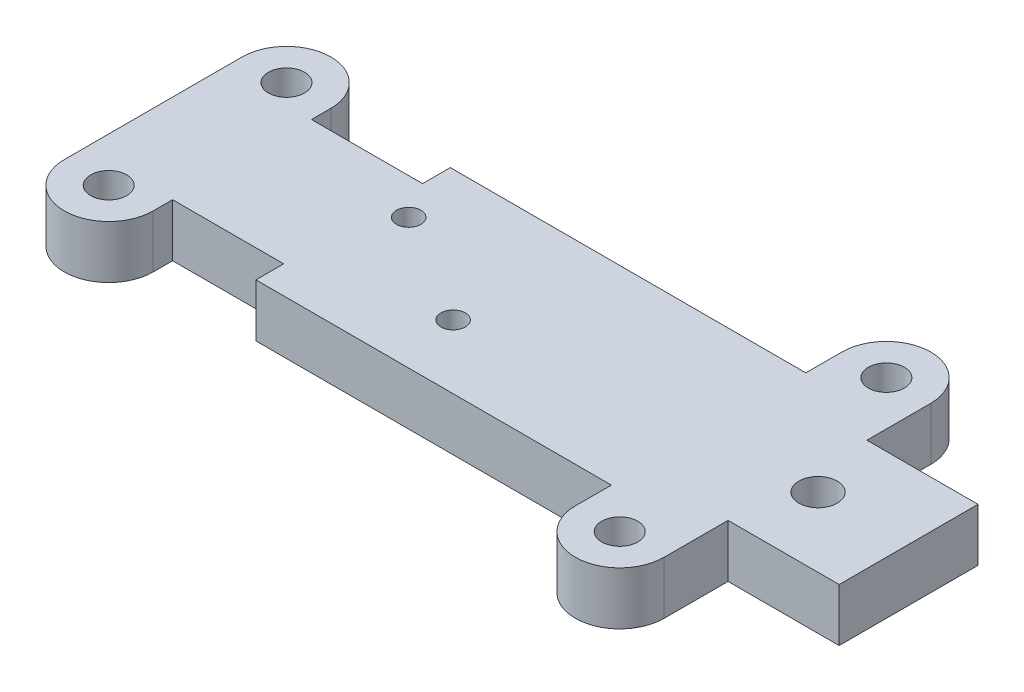
ISO-10303-21;
HEADER;
FILE_DESCRIPTION(('STEP AP214'),'2;1');
FILE_NAME('part.step','',(''),(''),'','','');
FILE_SCHEMA(('AUTOMOTIVE_DESIGN { 1 0 10303 214 1 1 1 1 }'));
ENDSEC;
DATA;
#1=APPLICATION_CONTEXT('core data for automotive mechanical design processes');
#2=APPLICATION_PROTOCOL_DEFINITION('international standard','automotive_design',2000,#1);
#3=PRODUCT_CONTEXT('',#1,'mechanical');
#4=PRODUCT('Part','Part','',(#3));
#5=PRODUCT_RELATED_PRODUCT_CATEGORY('part','',(#4));
#6=PRODUCT_DEFINITION_FORMATION('','',#4);
#7=PRODUCT_DEFINITION_CONTEXT('part definition',#1,'design');
#8=PRODUCT_DEFINITION('design','',#6,#7);
#9=PRODUCT_DEFINITION_SHAPE('','',#8);
#10=(LENGTH_UNIT() NAMED_UNIT(*) SI_UNIT(.MILLI.,.METRE.));
#11=(NAMED_UNIT(*) PLANE_ANGLE_UNIT() SI_UNIT($,.RADIAN.));
#12=(NAMED_UNIT(*) SI_UNIT($,.STERADIAN.) SOLID_ANGLE_UNIT());
#13=UNCERTAINTY_MEASURE_WITH_UNIT(LENGTH_MEASURE(1.E-05),#10,'distance_accuracy_value','');
#14=(GEOMETRIC_REPRESENTATION_CONTEXT(3) GLOBAL_UNCERTAINTY_ASSIGNED_CONTEXT((#13)) GLOBAL_UNIT_ASSIGNED_CONTEXT((#10,
#11,#12)) REPRESENTATION_CONTEXT('',''));
#15=CARTESIAN_POINT('',(0.,0.,0.));
#16=DIRECTION('',(0.,0.,1.));
#17=DIRECTION('',(1.,0.,0.));
#18=AXIS2_PLACEMENT_3D('',#15,#16,#17);
#19=CARTESIAN_POINT('',(29.,4.7625,-12.));
#20=DIRECTION('',(0.,-1.,0.));
#21=DIRECTION('',(0.,0.,-1.));
#22=AXIS2_PLACEMENT_3D('',#19,#20,#21);
#23=PLANE('',#22);
#24=CARTESIAN_POINT('',(-21.,4.7625,8.));
#25=DIRECTION('',(0.,-1.,0.));
#26=DIRECTION('',(0.,0.,-1.));
#27=AXIS2_PLACEMENT_3D('',#24,#25,#26);
#28=CIRCLE('',#27,1.625);
#29=CARTESIAN_POINT('',(-21.,4.7625,6.375));
#30=VERTEX_POINT('',#29);
#31=EDGE_CURVE('E392',#30,#30,#28,.T.);
#32=ORIENTED_EDGE('',*,*,#31,.T.);
#33=EDGE_LOOP('',(#32));
#34=FACE_BOUND('',#33,.T.);
#35=CARTESIAN_POINT('',(29.,4.7625,12.));
#36=DIRECTION('',(0.,-1.,0.));
#37=DIRECTION('',(0.,0.,-1.));
#38=AXIS2_PLACEMENT_3D('',#35,#36,#37);
#39=CIRCLE('',#38,1.625);
#40=CARTESIAN_POINT('',(29.,4.7625,10.375));
#41=VERTEX_POINT('',#40);
#42=EDGE_CURVE('E386',#41,#41,#39,.T.);
#43=ORIENTED_EDGE('',*,*,#42,.T.);
#44=EDGE_LOOP('',(#43));
#45=FACE_BOUND('',#44,.T.);
#46=CARTESIAN_POINT('',(29.,4.7625,-12.));
#47=DIRECTION('',(0.,1.,0.));
#48=DIRECTION('',(0.,0.,1.));
#49=AXIS2_PLACEMENT_3D('',#46,#47,#48);
#50=CIRCLE('',#49,1.625);
#51=CARTESIAN_POINT('',(29.,4.7625,-10.375));
#52=VERTEX_POINT('',#51);
#53=EDGE_CURVE('E249',#52,#52,#50,.T.);
#54=ORIENTED_EDGE('',*,*,#53,.F.);
#55=EDGE_LOOP('',(#54));
#56=FACE_BOUND('',#55,.T.);
#57=DIRECTION('',(-1.,0.,0.));
#58=VECTOR('',#57,1.);
#59=CARTESIAN_POINT('',(-17.,4.7625,-6.25));
#60=LINE('',#59,#58);
#61=CARTESIAN_POINT('',(-7.,4.7625,-6.25));
#62=VERTEX_POINT('',#61);
#63=CARTESIAN_POINT('',(-17.,4.7625,-6.25));
#64=VERTEX_POINT('',#63);
#65=EDGE_CURVE('E171',#62,#64,#60,.T.);
#66=ORIENTED_EDGE('',*,*,#65,.T.);
#67=DIRECTION('',(0.,0.,-1.));
#68=VECTOR('',#67,1.);
#69=CARTESIAN_POINT('',(-17.,4.7625,-6.25));
#70=LINE('',#69,#68);
#71=CARTESIAN_POINT('',(-17.,4.7625,-8.));
#72=VERTEX_POINT('',#71);
#73=EDGE_CURVE('E103',#64,#72,#70,.T.);
#74=ORIENTED_EDGE('',*,*,#73,.T.);
#75=CARTESIAN_POINT('',(-21.,4.7625,-8.));
#76=DIRECTION('',(0.,1.,0.));
#77=DIRECTION('',(0.,0.,1.));
#78=AXIS2_PLACEMENT_3D('',#75,#76,#77);
#79=CIRCLE('',#78,4.);
#80=CARTESIAN_POINT('',(-25.,4.7625,-8.));
#81=VERTEX_POINT('',#80);
#82=EDGE_CURVE('E193',#72,#81,#79,.T.);
#83=ORIENTED_EDGE('',*,*,#82,.T.);
#84=DIRECTION('',(0.,0.,1.));
#85=VECTOR('',#84,1.);
#86=CARTESIAN_POINT('',(-25.,4.7625,-8.));
#87=LINE('',#86,#85);
#88=CARTESIAN_POINT('',(-25.,4.7625,8.));
#89=VERTEX_POINT('',#88);
#90=EDGE_CURVE('E262',#81,#89,#87,.T.);
#91=ORIENTED_EDGE('',*,*,#90,.T.);
#92=CARTESIAN_POINT('',(-21.,4.7625,8.));
#93=DIRECTION('',(0.,-1.,0.));
#94=DIRECTION('',(0.,0.,-1.));
#95=AXIS2_PLACEMENT_3D('',#92,#93,#94);
#96=CIRCLE('',#95,4.);
#97=CARTESIAN_POINT('',(-17.,4.7625,8.));
#98=VERTEX_POINT('',#97);
#99=EDGE_CURVE('E219',#98,#89,#96,.T.);
#100=ORIENTED_EDGE('',*,*,#99,.F.);
#101=DIRECTION('',(0.,0.,1.));
#102=VECTOR('',#101,1.);
#103=CARTESIAN_POINT('',(-17.,4.7625,6.25));
#104=LINE('',#103,#102);
#105=CARTESIAN_POINT('',(-17.,4.7625,6.25));
#106=VERTEX_POINT('',#105);
#107=EDGE_CURVE('E420',#106,#98,#104,.T.);
#108=ORIENTED_EDGE('',*,*,#107,.F.);
#109=DIRECTION('',(-1.,0.,0.));
#110=VECTOR('',#109,1.);
#111=CARTESIAN_POINT('',(-17.,4.7625,6.25));
#112=LINE('',#111,#110);
#113=CARTESIAN_POINT('',(-7.,4.7625,6.25));
#114=VERTEX_POINT('',#113);
#115=EDGE_CURVE('E397',#114,#106,#112,.T.);
#116=ORIENTED_EDGE('',*,*,#115,.F.);
#117=DIRECTION('',(0.,0.,-1.));
#118=VECTOR('',#117,1.);
#119=CARTESIAN_POINT('',(-7.,4.7625,8.75));
#120=LINE('',#119,#118);
#121=CARTESIAN_POINT('',(-7.,4.7625,8.75));
#122=VERTEX_POINT('',#121);
#123=EDGE_CURVE('E400',#122,#114,#120,.T.);
#124=ORIENTED_EDGE('',*,*,#123,.F.);
#125=DIRECTION('',(-1.,0.,0.));
#126=VECTOR('',#125,1.);
#127=CARTESIAN_POINT('',(-7.,4.7625,8.75));
#128=LINE('',#127,#126);
#129=CARTESIAN_POINT('',(25.,4.7625,8.75));
#130=VERTEX_POINT('',#129);
#131=EDGE_CURVE('E404',#130,#122,#128,.T.);
#132=ORIENTED_EDGE('',*,*,#131,.F.);
#133=DIRECTION('',(0.,0.,-1.));
#134=VECTOR('',#133,1.);
#135=CARTESIAN_POINT('',(25.,4.7625,8.75));
#136=LINE('',#135,#134);
#137=CARTESIAN_POINT('',(25.,4.7625,12.));
#138=VERTEX_POINT('',#137);
#139=EDGE_CURVE('E407',#138,#130,#136,.T.);
#140=ORIENTED_EDGE('',*,*,#139,.F.);
#141=CARTESIAN_POINT('',(29.,4.7625,12.));
#142=DIRECTION('',(0.,-1.,0.));
#143=DIRECTION('',(0.,0.,1.));
#144=AXIS2_PLACEMENT_3D('',#141,#142,#143);
#145=CIRCLE('',#144,4.);
#146=CARTESIAN_POINT('',(33.,4.7625,12.));
#147=VERTEX_POINT('',#146);
#148=EDGE_CURVE('E410',#147,#138,#145,.T.);
#149=ORIENTED_EDGE('',*,*,#148,.F.);
#150=DIRECTION('',(0.,0.,1.));
#151=VECTOR('',#150,1.);
#152=CARTESIAN_POINT('',(33.,4.7625,6.25));
#153=LINE('',#152,#151);
#154=CARTESIAN_POINT('',(33.,4.7625,6.25));
#155=VERTEX_POINT('',#154);
#156=EDGE_CURVE('E413',#155,#147,#153,.T.);
#157=ORIENTED_EDGE('',*,*,#156,.F.);
#158=DIRECTION('',(-1.,0.,0.));
#159=VECTOR('',#158,1.);
#160=CARTESIAN_POINT('',(33.,4.7625,6.25));
#161=LINE('',#160,#159);
#162=CARTESIAN_POINT('',(43.,4.7625,6.25));
#163=VERTEX_POINT('',#162);
#164=EDGE_CURVE('E416',#163,#155,#161,.T.);
#165=ORIENTED_EDGE('',*,*,#164,.F.);
#166=DIRECTION('',(0.,0.,-1.));
#167=VECTOR('',#166,1.);
#168=CARTESIAN_POINT('',(43.,4.7625,-6.25));
#169=LINE('',#168,#167);
#170=CARTESIAN_POINT('',(43.,4.7625,-6.25));
#171=VERTEX_POINT('',#170);
#172=EDGE_CURVE('E265',#163,#171,#169,.T.);
#173=ORIENTED_EDGE('',*,*,#172,.T.);
#174=DIRECTION('',(-1.,0.,0.));
#175=VECTOR('',#174,1.);
#176=CARTESIAN_POINT('',(33.,4.7625,-6.25));
#177=LINE('',#176,#175);
#178=CARTESIAN_POINT('',(33.,4.7625,-6.25));
#179=VERTEX_POINT('',#178);
#180=EDGE_CURVE('E267',#171,#179,#177,.T.);
#181=ORIENTED_EDGE('',*,*,#180,.T.);
#182=DIRECTION('',(0.,0.,-1.));
#183=VECTOR('',#182,1.);
#184=CARTESIAN_POINT('',(33.,4.7625,-6.25));
#185=LINE('',#184,#183);
#186=CARTESIAN_POINT('',(33.,4.7625,-12.));
#187=VERTEX_POINT('',#186);
#188=EDGE_CURVE('E269',#179,#187,#185,.T.);
#189=ORIENTED_EDGE('',*,*,#188,.T.);
#190=CARTESIAN_POINT('',(29.,4.7625,-12.));
#191=DIRECTION('',(0.,1.,0.));
#192=DIRECTION('',(0.,0.,-1.));
#193=AXIS2_PLACEMENT_3D('',#190,#191,#192);
#194=CIRCLE('',#193,4.);
#195=CARTESIAN_POINT('',(25.,4.7625,-12.));
#196=VERTEX_POINT('',#195);
#197=EDGE_CURVE('E131',#187,#196,#194,.T.);
#198=ORIENTED_EDGE('',*,*,#197,.T.);
#199=DIRECTION('',(0.,0.,1.));
#200=VECTOR('',#199,1.);
#201=CARTESIAN_POINT('',(25.,4.7625,-8.75));
#202=LINE('',#201,#200);
#203=CARTESIAN_POINT('',(25.,4.7625,-8.75));
#204=VERTEX_POINT('',#203);
#205=EDGE_CURVE('E125',#196,#204,#202,.T.);
#206=ORIENTED_EDGE('',*,*,#205,.T.);
#207=DIRECTION('',(-1.,0.,0.));
#208=VECTOR('',#207,1.);
#209=CARTESIAN_POINT('',(-7.,4.7625,-8.75));
#210=LINE('',#209,#208);
#211=CARTESIAN_POINT('',(-7.,4.7625,-8.75));
#212=VERTEX_POINT('',#211);
#213=EDGE_CURVE('E129',#204,#212,#210,.T.);
#214=ORIENTED_EDGE('',*,*,#213,.T.);
#215=DIRECTION('',(0.,0.,1.));
#216=VECTOR('',#215,1.);
#217=CARTESIAN_POINT('',(-7.,4.7625,-8.75));
#218=LINE('',#217,#216);
#219=EDGE_CURVE('E53',#212,#62,#218,.T.);
#220=ORIENTED_EDGE('',*,*,#219,.T.);
#221=EDGE_LOOP('',(#66,#74,#83,#91,#100,#108,#116,#124,#132,#140,#149,#157,#165,#173,#181,#189,
#198,#206,#214,#220));
#222=FACE_BOUND('',#221,.T.);
#223=CARTESIAN_POINT('',(-21.,4.7625,-8.));
#224=DIRECTION('',(0.,1.,0.));
#225=DIRECTION('',(0.,0.,1.));
#226=AXIS2_PLACEMENT_3D('',#223,#224,#225);
#227=CIRCLE('',#226,1.625);
#228=CARTESIAN_POINT('',(-21.,4.7625,-6.375));
#229=VERTEX_POINT('',#228);
#230=EDGE_CURVE('E153',#229,#229,#227,.T.);
#231=ORIENTED_EDGE('',*,*,#230,.F.);
#232=EDGE_LOOP('',(#231));
#233=FACE_BOUND('',#232,.T.);
#234=CARTESIAN_POINT('',(5.,4.7625,3.));
#235=DIRECTION('',(0.,1.,0.));
#236=DIRECTION('',(0.,0.,1.));
#237=AXIS2_PLACEMENT_3D('',#234,#235,#236);
#238=CIRCLE('',#237,1.1);
#239=CARTESIAN_POINT('',(5.,4.7625,4.1));
#240=VERTEX_POINT('',#239);
#241=EDGE_CURVE('E377',#240,#240,#238,.T.);
#242=ORIENTED_EDGE('',*,*,#241,.F.);
#243=EDGE_LOOP('',(#242));
#244=FACE_BOUND('',#243,.T.);
#245=CARTESIAN_POINT('',(-5.,4.7625,-3.));
#246=DIRECTION('',(0.,1.,0.));
#247=DIRECTION('',(0.,0.,1.));
#248=AXIS2_PLACEMENT_3D('',#245,#246,#247);
#249=CIRCLE('',#248,1.1);
#250=CARTESIAN_POINT('',(-5.,4.7625,-1.9));
#251=VERTEX_POINT('',#250);
#252=EDGE_CURVE('E372',#251,#251,#249,.T.);
#253=ORIENTED_EDGE('',*,*,#252,.F.);
#254=EDGE_LOOP('',(#253));
#255=FACE_BOUND('',#254,.T.);
#256=CARTESIAN_POINT('',(34.85,4.7625,0.));
#257=DIRECTION('',(0.,1.,0.));
#258=DIRECTION('',(0.,0.,1.));
#259=AXIS2_PLACEMENT_3D('',#256,#257,#258);
#260=CIRCLE('',#259,1.72719999999999);
#261=CARTESIAN_POINT('',(34.85,4.7625,1.72719999999999));
#262=VERTEX_POINT('',#261);
#263=EDGE_CURVE('E369',#262,#262,#260,.T.);
#264=ORIENTED_EDGE('',*,*,#263,.F.);
#265=EDGE_LOOP('',(#264));
#266=FACE_BOUND('',#265,.T.);
#267=ADVANCED_FACE('F35',(#34,#45,#56,#222,#233,#244,#255,#266),#23,.F.);
#268=CARTESIAN_POINT('',(29.,0.,-12.));
#269=DIRECTION('',(0.,-1.,0.));
#270=DIRECTION('',(0.,0.,-1.));
#271=AXIS2_PLACEMENT_3D('',#268,#269,#270);
#272=PLANE('',#271);
#273=CARTESIAN_POINT('',(34.85,0.,0.));
#274=DIRECTION('',(0.,-1.,0.));
#275=DIRECTION('',(0.,0.,-1.));
#276=AXIS2_PLACEMENT_3D('',#273,#274,#275);
#277=CIRCLE('',#276,1.72719999999999);
#278=CARTESIAN_POINT('',(34.85,0.,-1.72719999999999));
#279=VERTEX_POINT('',#278);
#280=EDGE_CURVE('E39',#279,#279,#277,.T.);
#281=ORIENTED_EDGE('',*,*,#280,.F.);
#282=EDGE_LOOP('',(#281));
#283=FACE_BOUND('',#282,.T.);
#284=CARTESIAN_POINT('',(-5.,0.,-3.));
#285=DIRECTION('',(0.,1.,0.));
#286=DIRECTION('',(0.,0.,1.));
#287=AXIS2_PLACEMENT_3D('',#284,#285,#286);
#288=CIRCLE('',#287,1.1);
#289=CARTESIAN_POINT('',(-5.,0.,-1.9));
#290=VERTEX_POINT('',#289);
#291=EDGE_CURVE('E374',#290,#290,#288,.T.);
#292=ORIENTED_EDGE('',*,*,#291,.T.);
#293=EDGE_LOOP('',(#292));
#294=FACE_BOUND('',#293,.T.);
#295=CARTESIAN_POINT('',(5.,0.,3.));
#296=DIRECTION('',(0.,1.,0.));
#297=DIRECTION('',(0.,0.,1.));
#298=AXIS2_PLACEMENT_3D('',#295,#296,#297);
#299=CIRCLE('',#298,1.1);
#300=CARTESIAN_POINT('',(5.,0.,4.1));
#301=VERTEX_POINT('',#300);
#302=EDGE_CURVE('E380',#301,#301,#299,.T.);
#303=ORIENTED_EDGE('',*,*,#302,.T.);
#304=EDGE_LOOP('',(#303));
#305=FACE_BOUND('',#304,.T.);
#306=CARTESIAN_POINT('',(-21.,0.,-8.));
#307=DIRECTION('',(0.,1.,0.));
#308=DIRECTION('',(0.,0.,1.));
#309=AXIS2_PLACEMENT_3D('',#306,#307,#308);
#310=CIRCLE('',#309,1.625);
#311=CARTESIAN_POINT('',(-21.,0.,-6.375));
#312=VERTEX_POINT('',#311);
#313=EDGE_CURVE('E252',#312,#312,#310,.T.);
#314=ORIENTED_EDGE('',*,*,#313,.T.);
#315=EDGE_LOOP('',(#314));
#316=FACE_BOUND('',#315,.T.);
#317=DIRECTION('',(-1.,0.,0.));
#318=VECTOR('',#317,1.);
#319=CARTESIAN_POINT('',(-17.,0.,-6.25));
#320=LINE('',#319,#318);
#321=CARTESIAN_POINT('',(-7.,0.,-6.25));
#322=VERTEX_POINT('',#321);
#323=CARTESIAN_POINT('',(-17.,0.,-6.25));
#324=VERTEX_POINT('',#323);
#325=EDGE_CURVE('E149',#322,#324,#320,.T.);
#326=ORIENTED_EDGE('',*,*,#325,.F.);
#327=DIRECTION('',(0.,0.,1.));
#328=VECTOR('',#327,1.);
#329=CARTESIAN_POINT('',(-7.,0.,-8.75));
#330=LINE('',#329,#328);
#331=CARTESIAN_POINT('',(-7.,0.,-8.75));
#332=VERTEX_POINT('',#331);
#333=EDGE_CURVE('E95',#332,#322,#330,.T.);
#334=ORIENTED_EDGE('',*,*,#333,.F.);
#335=DIRECTION('',(-1.,0.,0.));
#336=VECTOR('',#335,1.);
#337=CARTESIAN_POINT('',(-7.,0.,-8.75));
#338=LINE('',#337,#336);
#339=CARTESIAN_POINT('',(25.,0.,-8.75));
#340=VERTEX_POINT('',#339);
#341=EDGE_CURVE('E89',#340,#332,#338,.T.);
#342=ORIENTED_EDGE('',*,*,#341,.F.);
#343=DIRECTION('',(0.,0.,1.));
#344=VECTOR('',#343,1.);
#345=CARTESIAN_POINT('',(25.,0.,-8.75));
#346=LINE('',#345,#344);
#347=CARTESIAN_POINT('',(25.,0.,-12.));
#348=VERTEX_POINT('',#347);
#349=EDGE_CURVE('E139',#348,#340,#346,.T.);
#350=ORIENTED_EDGE('',*,*,#349,.F.);
#351=CARTESIAN_POINT('',(29.,0.,-12.));
#352=DIRECTION('',(0.,1.,0.));
#353=DIRECTION('',(0.,0.,-1.));
#354=AXIS2_PLACEMENT_3D('',#351,#352,#353);
#355=CIRCLE('',#354,4.);
#356=CARTESIAN_POINT('',(33.,0.,-12.));
#357=VERTEX_POINT('',#356);
#358=EDGE_CURVE('E166',#357,#348,#355,.T.);
#359=ORIENTED_EDGE('',*,*,#358,.F.);
#360=DIRECTION('',(0.,0.,-1.));
#361=VECTOR('',#360,1.);
#362=CARTESIAN_POINT('',(33.,0.,-6.25));
#363=LINE('',#362,#361);
#364=CARTESIAN_POINT('',(33.,0.,-6.25));
#365=VERTEX_POINT('',#364);
#366=EDGE_CURVE('E164',#365,#357,#363,.T.);
#367=ORIENTED_EDGE('',*,*,#366,.F.);
#368=DIRECTION('',(-1.,0.,0.));
#369=VECTOR('',#368,1.);
#370=CARTESIAN_POINT('',(33.,0.,-6.25));
#371=LINE('',#370,#369);
#372=CARTESIAN_POINT('',(43.,0.,-6.25));
#373=VERTEX_POINT('',#372);
#374=EDGE_CURVE('E162',#373,#365,#371,.T.);
#375=ORIENTED_EDGE('',*,*,#374,.F.);
#376=DIRECTION('',(0.,0.,-1.));
#377=VECTOR('',#376,1.);
#378=CARTESIAN_POINT('',(43.,0.,-6.25));
#379=LINE('',#378,#377);
#380=CARTESIAN_POINT('',(43.,0.,6.25));
#381=VERTEX_POINT('',#380);
#382=EDGE_CURVE('E160',#381,#373,#379,.T.);
#383=ORIENTED_EDGE('',*,*,#382,.F.);
#384=DIRECTION('',(-1.,0.,0.));
#385=VECTOR('',#384,1.);
#386=CARTESIAN_POINT('',(33.,0.,6.25));
#387=LINE('',#386,#385);
#388=CARTESIAN_POINT('',(33.,0.,6.25));
#389=VERTEX_POINT('',#388);
#390=EDGE_CURVE('E440',#381,#389,#387,.T.);
#391=ORIENTED_EDGE('',*,*,#390,.T.);
#392=DIRECTION('',(0.,0.,1.));
#393=VECTOR('',#392,1.);
#394=CARTESIAN_POINT('',(33.,0.,6.25));
#395=LINE('',#394,#393);
#396=CARTESIAN_POINT('',(33.,0.,12.));
#397=VERTEX_POINT('',#396);
#398=EDGE_CURVE('E437',#389,#397,#395,.T.);
#399=ORIENTED_EDGE('',*,*,#398,.T.);
#400=CARTESIAN_POINT('',(29.,0.,12.));
#401=DIRECTION('',(0.,-1.,0.));
#402=DIRECTION('',(0.,0.,1.));
#403=AXIS2_PLACEMENT_3D('',#400,#401,#402);
#404=CIRCLE('',#403,4.);
#405=CARTESIAN_POINT('',(25.,0.,12.));
#406=VERTEX_POINT('',#405);
#407=EDGE_CURVE('E434',#397,#406,#404,.T.);
#408=ORIENTED_EDGE('',*,*,#407,.T.);
#409=DIRECTION('',(0.,0.,-1.));
#410=VECTOR('',#409,1.);
#411=CARTESIAN_POINT('',(25.,0.,8.75));
#412=LINE('',#411,#410);
#413=CARTESIAN_POINT('',(25.,0.,8.75));
#414=VERTEX_POINT('',#413);
#415=EDGE_CURVE('E431',#406,#414,#412,.T.);
#416=ORIENTED_EDGE('',*,*,#415,.T.);
#417=DIRECTION('',(-1.,0.,0.));
#418=VECTOR('',#417,1.);
#419=CARTESIAN_POINT('',(-7.,0.,8.75));
#420=LINE('',#419,#418);
#421=CARTESIAN_POINT('',(-7.,0.,8.75));
#422=VERTEX_POINT('',#421);
#423=EDGE_CURVE('E428',#414,#422,#420,.T.);
#424=ORIENTED_EDGE('',*,*,#423,.T.);
#425=DIRECTION('',(0.,0.,-1.));
#426=VECTOR('',#425,1.);
#427=CARTESIAN_POINT('',(-7.,0.,8.75));
#428=LINE('',#427,#426);
#429=CARTESIAN_POINT('',(-7.,0.,6.25));
#430=VERTEX_POINT('',#429);
#431=EDGE_CURVE('E425',#422,#430,#428,.T.);
#432=ORIENTED_EDGE('',*,*,#431,.T.);
#433=DIRECTION('',(-1.,0.,0.));
#434=VECTOR('',#433,1.);
#435=CARTESIAN_POINT('',(-17.,0.,6.25));
#436=LINE('',#435,#434);
#437=CARTESIAN_POINT('',(-17.,0.,6.25));
#438=VERTEX_POINT('',#437);
#439=EDGE_CURVE('E394',#430,#438,#436,.T.);
#440=ORIENTED_EDGE('',*,*,#439,.T.);
#441=DIRECTION('',(0.,0.,1.));
#442=VECTOR('',#441,1.);
#443=CARTESIAN_POINT('',(-17.,0.,6.25));
#444=LINE('',#443,#442);
#445=CARTESIAN_POINT('',(-17.,0.,8.));
#446=VERTEX_POINT('',#445);
#447=EDGE_CURVE('E401',#438,#446,#444,.T.);
#448=ORIENTED_EDGE('',*,*,#447,.T.);
#449=CARTESIAN_POINT('',(-21.,0.,8.));
#450=DIRECTION('',(0.,-1.,0.));
#451=DIRECTION('',(0.,0.,-1.));
#452=AXIS2_PLACEMENT_3D('',#449,#450,#451);
#453=CIRCLE('',#452,4.);
#454=CARTESIAN_POINT('',(-25.,0.,8.));
#455=VERTEX_POINT('',#454);
#456=EDGE_CURVE('E203',#446,#455,#453,.T.);
#457=ORIENTED_EDGE('',*,*,#456,.T.);
#458=DIRECTION('',(0.,0.,1.));
#459=VECTOR('',#458,1.);
#460=CARTESIAN_POINT('',(-25.,0.,-8.));
#461=LINE('',#460,#459);
#462=CARTESIAN_POINT('',(-25.,0.,-8.));
#463=VERTEX_POINT('',#462);
#464=EDGE_CURVE('E157',#463,#455,#461,.T.);
#465=ORIENTED_EDGE('',*,*,#464,.F.);
#466=CARTESIAN_POINT('',(-21.,0.,-8.));
#467=DIRECTION('',(0.,1.,0.));
#468=DIRECTION('',(0.,0.,1.));
#469=AXIS2_PLACEMENT_3D('',#466,#467,#468);
#470=CIRCLE('',#469,4.);
#471=CARTESIAN_POINT('',(-17.,0.,-8.));
#472=VERTEX_POINT('',#471);
#473=EDGE_CURVE('E155',#472,#463,#470,.T.);
#474=ORIENTED_EDGE('',*,*,#473,.F.);
#475=DIRECTION('',(0.,0.,-1.));
#476=VECTOR('',#475,1.);
#477=CARTESIAN_POINT('',(-17.,0.,-6.25));
#478=LINE('',#477,#476);
#479=EDGE_CURVE('E152',#324,#472,#478,.T.);
#480=ORIENTED_EDGE('',*,*,#479,.F.);
#481=EDGE_LOOP('',(#326,#334,#342,#350,#359,#367,#375,#383,#391,#399,#408,#416,#424,#432,#440,
#448,#457,#465,#474,#480));
#482=FACE_BOUND('',#481,.T.);
#483=CARTESIAN_POINT('',(29.,0.,-12.));
#484=DIRECTION('',(0.,1.,0.));
#485=DIRECTION('',(0.,0.,1.));
#486=AXIS2_PLACEMENT_3D('',#483,#484,#485);
#487=CIRCLE('',#486,1.625);
#488=CARTESIAN_POINT('',(29.,0.,-10.375));
#489=VERTEX_POINT('',#488);
#490=EDGE_CURVE('E248',#489,#489,#487,.T.);
#491=ORIENTED_EDGE('',*,*,#490,.T.);
#492=EDGE_LOOP('',(#491));
#493=FACE_BOUND('',#492,.T.);
#494=CARTESIAN_POINT('',(29.,0.,12.));
#495=DIRECTION('',(0.,-1.,0.));
#496=DIRECTION('',(0.,0.,-1.));
#497=AXIS2_PLACEMENT_3D('',#494,#495,#496);
#498=CIRCLE('',#497,1.625);
#499=CARTESIAN_POINT('',(29.,0.,10.375));
#500=VERTEX_POINT('',#499);
#501=EDGE_CURVE('E383',#500,#500,#498,.T.);
#502=ORIENTED_EDGE('',*,*,#501,.F.);
#503=EDGE_LOOP('',(#502));
#504=FACE_BOUND('',#503,.T.);
#505=CARTESIAN_POINT('',(-21.,0.,8.));
#506=DIRECTION('',(0.,-1.,0.));
#507=DIRECTION('',(0.,0.,-1.));
#508=AXIS2_PLACEMENT_3D('',#505,#506,#507);
#509=CIRCLE('',#508,1.625);
#510=CARTESIAN_POINT('',(-21.,0.,6.375));
#511=VERTEX_POINT('',#510);
#512=EDGE_CURVE('E389',#511,#511,#509,.T.);
#513=ORIENTED_EDGE('',*,*,#512,.F.);
#514=EDGE_LOOP('',(#513));
#515=FACE_BOUND('',#514,.T.);
#516=ADVANCED_FACE('F197',(#283,#294,#305,#316,#482,#493,#504,#515),#272,.T.);
#517=CARTESIAN_POINT('',(-17.,4.7625,-6.25));
#518=DIRECTION('',(0.,0.,1.));
#519=DIRECTION('',(1.,0.,0.));
#520=AXIS2_PLACEMENT_3D('',#517,#518,#519);
#521=PLANE('',#520);
#522=ORIENTED_EDGE('',*,*,#325,.T.);
#523=DIRECTION('',(0.,-1.,0.));
#524=VECTOR('',#523,1.);
#525=CARTESIAN_POINT('',(-17.,4.7625,-6.25));
#526=LINE('',#525,#524);
#527=EDGE_CURVE('E11',#64,#324,#526,.T.);
#528=ORIENTED_EDGE('',*,*,#527,.F.);
#529=ORIENTED_EDGE('',*,*,#65,.F.);
#530=DIRECTION('',(0.,-1.,0.));
#531=VECTOR('',#530,1.);
#532=CARTESIAN_POINT('',(-7.,4.7625,-6.25));
#533=LINE('',#532,#531);
#534=EDGE_CURVE('E145',#62,#322,#533,.T.);
#535=ORIENTED_EDGE('',*,*,#534,.T.);
#536=EDGE_LOOP('',(#522,#528,#529,#535));
#537=FACE_BOUND('',#536,.T.);
#538=ADVANCED_FACE('F37',(#537),#521,.F.);
#539=CARTESIAN_POINT('',(-17.,4.7625,-6.25));
#540=DIRECTION('',(-1.,0.,0.));
#541=DIRECTION('',(0.,0.,1.));
#542=AXIS2_PLACEMENT_3D('',#539,#540,#541);
#543=PLANE('',#542);
#544=ORIENTED_EDGE('',*,*,#479,.T.);
#545=DIRECTION('',(0.,-1.,0.));
#546=VECTOR('',#545,1.);
#547=CARTESIAN_POINT('',(-17.,4.7625,-8.));
#548=LINE('',#547,#546);
#549=EDGE_CURVE('E45',#72,#472,#548,.T.);
#550=ORIENTED_EDGE('',*,*,#549,.F.);
#551=ORIENTED_EDGE('',*,*,#73,.F.);
#552=ORIENTED_EDGE('',*,*,#527,.T.);
#553=EDGE_LOOP('',(#544,#550,#551,#552));
#554=FACE_BOUND('',#553,.T.);
#555=ADVANCED_FACE('F521',(#554),#543,.F.);
#556=CARTESIAN_POINT('',(-21.,4.7625,-8.));
#557=DIRECTION('',(0.,-1.,0.));
#558=DIRECTION('',(0.,0.,-1.));
#559=AXIS2_PLACEMENT_3D('',#556,#557,#558);
#560=CYLINDRICAL_SURFACE('',#559,4.);
#561=ORIENTED_EDGE('',*,*,#473,.T.);
#562=DIRECTION('',(0.,-1.,0.));
#563=VECTOR('',#562,1.);
#564=CARTESIAN_POINT('',(-25.,4.7625,-8.));
#565=LINE('',#564,#563);
#566=EDGE_CURVE('E184',#81,#463,#565,.T.);
#567=ORIENTED_EDGE('',*,*,#566,.F.);
#568=ORIENTED_EDGE('',*,*,#82,.F.);
#569=ORIENTED_EDGE('',*,*,#549,.T.);
#570=EDGE_LOOP('',(#561,#567,#568,#569));
#571=FACE_BOUND('',#570,.T.);
#572=ADVANCED_FACE('F191',(#571),#560,.T.);
#573=CARTESIAN_POINT('',(-25.,4.7625,-8.));
#574=DIRECTION('',(1.,0.,0.));
#575=DIRECTION('',(0.,0.,-1.));
#576=AXIS2_PLACEMENT_3D('',#573,#574,#575);
#577=PLANE('',#576);
#578=ORIENTED_EDGE('',*,*,#464,.T.);
#579=DIRECTION('',(0.,-1.,0.));
#580=VECTOR('',#579,1.);
#581=CARTESIAN_POINT('',(-25.,4.7625,8.));
#582=LINE('',#581,#580);
#583=EDGE_CURVE('E210',#89,#455,#582,.T.);
#584=ORIENTED_EDGE('',*,*,#583,.F.);
#585=ORIENTED_EDGE('',*,*,#90,.F.);
#586=ORIENTED_EDGE('',*,*,#566,.T.);
#587=EDGE_LOOP('',(#578,#584,#585,#586));
#588=FACE_BOUND('',#587,.T.);
#589=ADVANCED_FACE('F207',(#588),#577,.F.);
#590=CARTESIAN_POINT('',(43.,4.7625,-6.25));
#591=DIRECTION('',(-1.,0.,0.));
#592=DIRECTION('',(0.,0.,1.));
#593=AXIS2_PLACEMENT_3D('',#590,#591,#592);
#594=PLANE('',#593);
#595=ORIENTED_EDGE('',*,*,#382,.T.);
#596=DIRECTION('',(0.,-1.,0.));
#597=VECTOR('',#596,1.);
#598=CARTESIAN_POINT('',(43.,4.7625,-6.25));
#599=LINE('',#598,#597);
#600=EDGE_CURVE('E181',#171,#373,#599,.T.);
#601=ORIENTED_EDGE('',*,*,#600,.F.);
#602=ORIENTED_EDGE('',*,*,#172,.F.);
#603=DIRECTION('',(0.,-1.,0.));
#604=VECTOR('',#603,1.);
#605=CARTESIAN_POINT('',(43.,4.7625,6.25));
#606=LINE('',#605,#604);
#607=EDGE_CURVE('E220',#163,#381,#606,.T.);
#608=ORIENTED_EDGE('',*,*,#607,.T.);
#609=EDGE_LOOP('',(#595,#601,#602,#608));
#610=FACE_BOUND('',#609,.T.);
#611=ADVANCED_FACE('F481',(#610),#594,.F.);
#612=CARTESIAN_POINT('',(33.,4.7625,-6.25));
#613=DIRECTION('',(0.,0.,1.));
#614=DIRECTION('',(1.,0.,0.));
#615=AXIS2_PLACEMENT_3D('',#612,#613,#614);
#616=PLANE('',#615);
#617=ORIENTED_EDGE('',*,*,#374,.T.);
#618=DIRECTION('',(0.,-1.,0.));
#619=VECTOR('',#618,1.);
#620=CARTESIAN_POINT('',(33.,4.7625,-6.25));
#621=LINE('',#620,#619);
#622=EDGE_CURVE('E178',#179,#365,#621,.T.);
#623=ORIENTED_EDGE('',*,*,#622,.F.);
#624=ORIENTED_EDGE('',*,*,#180,.F.);
#625=ORIENTED_EDGE('',*,*,#600,.T.);
#626=EDGE_LOOP('',(#617,#623,#624,#625));
#627=FACE_BOUND('',#626,.T.);
#628=ADVANCED_FACE('F507',(#627),#616,.F.);
#629=CARTESIAN_POINT('',(33.,4.7625,-6.25));
#630=DIRECTION('',(-1.,0.,0.));
#631=DIRECTION('',(0.,0.,1.));
#632=AXIS2_PLACEMENT_3D('',#629,#630,#631);
#633=PLANE('',#632);
#634=ORIENTED_EDGE('',*,*,#366,.T.);
#635=DIRECTION('',(0.,-1.,0.));
#636=VECTOR('',#635,1.);
#637=CARTESIAN_POINT('',(33.,4.7625,-12.));
#638=LINE('',#637,#636);
#639=EDGE_CURVE('E175',#187,#357,#638,.T.);
#640=ORIENTED_EDGE('',*,*,#639,.F.);
#641=ORIENTED_EDGE('',*,*,#188,.F.);
#642=ORIENTED_EDGE('',*,*,#622,.T.);
#643=EDGE_LOOP('',(#634,#640,#641,#642));
#644=FACE_BOUND('',#643,.T.);
#645=ADVANCED_FACE('F275',(#644),#633,.F.);
#646=CARTESIAN_POINT('',(29.,4.7625,-12.));
#647=DIRECTION('',(0.,-1.,0.));
#648=DIRECTION('',(0.,0.,-1.));
#649=AXIS2_PLACEMENT_3D('',#646,#647,#648);
#650=CYLINDRICAL_SURFACE('',#649,4.);
#651=ORIENTED_EDGE('',*,*,#358,.T.);
#652=DIRECTION('',(0.,-1.,0.));
#653=VECTOR('',#652,1.);
#654=CARTESIAN_POINT('',(25.,4.7625,-12.));
#655=LINE('',#654,#653);
#656=EDGE_CURVE('E140',#196,#348,#655,.T.);
#657=ORIENTED_EDGE('',*,*,#656,.F.);
#658=ORIENTED_EDGE('',*,*,#197,.F.);
#659=ORIENTED_EDGE('',*,*,#639,.T.);
#660=EDGE_LOOP('',(#651,#657,#658,#659));
#661=FACE_BOUND('',#660,.T.);
#662=ADVANCED_FACE('F279',(#661),#650,.T.);
#663=CARTESIAN_POINT('',(25.,4.7625,-8.75));
#664=DIRECTION('',(1.,0.,0.));
#665=DIRECTION('',(0.,0.,-1.));
#666=AXIS2_PLACEMENT_3D('',#663,#664,#665);
#667=PLANE('',#666);
#668=ORIENTED_EDGE('',*,*,#349,.T.);
#669=DIRECTION('',(0.,-1.,0.));
#670=VECTOR('',#669,1.);
#671=CARTESIAN_POINT('',(25.,4.7625,-8.75));
#672=LINE('',#671,#670);
#673=EDGE_CURVE('E136',#204,#340,#672,.T.);
#674=ORIENTED_EDGE('',*,*,#673,.F.);
#675=ORIENTED_EDGE('',*,*,#205,.F.);
#676=ORIENTED_EDGE('',*,*,#656,.T.);
#677=EDGE_LOOP('',(#668,#674,#675,#676));
#678=FACE_BOUND('',#677,.T.);
#679=ADVANCED_FACE('F137',(#678),#667,.F.);
#680=CARTESIAN_POINT('',(-7.,4.7625,-8.75));
#681=DIRECTION('',(0.,0.,1.));
#682=DIRECTION('',(1.,0.,0.));
#683=AXIS2_PLACEMENT_3D('',#680,#681,#682);
#684=PLANE('',#683);
#685=ORIENTED_EDGE('',*,*,#341,.T.);
#686=DIRECTION('',(0.,-1.,0.));
#687=VECTOR('',#686,1.);
#688=CARTESIAN_POINT('',(-7.,4.7625,-8.75));
#689=LINE('',#688,#687);
#690=EDGE_CURVE('E141',#212,#332,#689,.T.);
#691=ORIENTED_EDGE('',*,*,#690,.F.);
#692=ORIENTED_EDGE('',*,*,#213,.F.);
#693=ORIENTED_EDGE('',*,*,#673,.T.);
#694=EDGE_LOOP('',(#685,#691,#692,#693));
#695=FACE_BOUND('',#694,.T.);
#696=ADVANCED_FACE('F143',(#695),#684,.F.);
#697=CARTESIAN_POINT('',(-7.,4.7625,-8.75));
#698=DIRECTION('',(1.,0.,0.));
#699=DIRECTION('',(0.,0.,-1.));
#700=AXIS2_PLACEMENT_3D('',#697,#698,#699);
#701=PLANE('',#700);
#702=ORIENTED_EDGE('',*,*,#333,.T.);
#703=ORIENTED_EDGE('',*,*,#534,.F.);
#704=ORIENTED_EDGE('',*,*,#219,.F.);
#705=ORIENTED_EDGE('',*,*,#690,.T.);
#706=EDGE_LOOP('',(#702,#703,#704,#705));
#707=FACE_BOUND('',#706,.T.);
#708=ADVANCED_FACE('F283',(#707),#701,.F.);
#709=CARTESIAN_POINT('',(-21.,4.7625,-8.));
#710=DIRECTION('',(0.,-1.,0.));
#711=DIRECTION('',(0.,0.,-1.));
#712=AXIS2_PLACEMENT_3D('',#709,#710,#711);
#713=CYLINDRICAL_SURFACE('',#712,1.625);
#714=ORIENTED_EDGE('',*,*,#230,.T.);
#715=EDGE_LOOP('',(#714));
#716=FACE_BOUND('',#715,.T.);
#717=ORIENTED_EDGE('',*,*,#313,.F.);
#718=EDGE_LOOP('',(#717));
#719=FACE_BOUND('',#718,.T.);
#720=ADVANCED_FACE('F285',(#716,#719),#713,.F.);
#721=CARTESIAN_POINT('',(29.,4.7625,-12.));
#722=DIRECTION('',(0.,-1.,0.));
#723=DIRECTION('',(0.,0.,-1.));
#724=AXIS2_PLACEMENT_3D('',#721,#722,#723);
#725=CYLINDRICAL_SURFACE('',#724,1.625);
#726=ORIENTED_EDGE('',*,*,#53,.T.);
#727=EDGE_LOOP('',(#726));
#728=FACE_BOUND('',#727,.T.);
#729=ORIENTED_EDGE('',*,*,#490,.F.);
#730=EDGE_LOOP('',(#729));
#731=FACE_BOUND('',#730,.T.);
#732=ADVANCED_FACE('F291',(#728,#731),#725,.F.);
#733=CARTESIAN_POINT('',(-17.,4.7625,6.25));
#734=DIRECTION('',(0.,0.,1.));
#735=DIRECTION('',(1.,0.,0.));
#736=AXIS2_PLACEMENT_3D('',#733,#734,#735);
#737=PLANE('',#736);
#738=ORIENTED_EDGE('',*,*,#439,.F.);
#739=DIRECTION('',(0.,-1.,0.));
#740=VECTOR('',#739,1.);
#741=CARTESIAN_POINT('',(-7.,4.7625,6.25));
#742=LINE('',#741,#740);
#743=EDGE_CURVE('E245',#114,#430,#742,.T.);
#744=ORIENTED_EDGE('',*,*,#743,.F.);
#745=ORIENTED_EDGE('',*,*,#115,.T.);
#746=DIRECTION('',(0.,-1.,0.));
#747=VECTOR('',#746,1.);
#748=CARTESIAN_POINT('',(-17.,4.7625,6.25));
#749=LINE('',#748,#747);
#750=EDGE_CURVE('E227',#106,#438,#749,.T.);
#751=ORIENTED_EDGE('',*,*,#750,.T.);
#752=EDGE_LOOP('',(#738,#744,#745,#751));
#753=FACE_BOUND('',#752,.T.);
#754=ADVANCED_FACE('F308',(#753),#737,.T.);
#755=CARTESIAN_POINT('',(-7.,4.7625,8.75));
#756=DIRECTION('',(-1.,0.,0.));
#757=DIRECTION('',(0.,0.,1.));
#758=AXIS2_PLACEMENT_3D('',#755,#756,#757);
#759=PLANE('',#758);
#760=ORIENTED_EDGE('',*,*,#431,.F.);
#761=DIRECTION('',(0.,-1.,0.));
#762=VECTOR('',#761,1.);
#763=CARTESIAN_POINT('',(-7.,4.7625,8.75));
#764=LINE('',#763,#762);
#765=EDGE_CURVE('E242',#122,#422,#764,.T.);
#766=ORIENTED_EDGE('',*,*,#765,.F.);
#767=ORIENTED_EDGE('',*,*,#123,.T.);
#768=ORIENTED_EDGE('',*,*,#743,.T.);
#769=EDGE_LOOP('',(#760,#766,#767,#768));
#770=FACE_BOUND('',#769,.T.);
#771=ADVANCED_FACE('F312',(#770),#759,.T.);
#772=CARTESIAN_POINT('',(-7.,4.7625,8.75));
#773=DIRECTION('',(0.,0.,1.));
#774=DIRECTION('',(1.,0.,0.));
#775=AXIS2_PLACEMENT_3D('',#772,#773,#774);
#776=PLANE('',#775);
#777=ORIENTED_EDGE('',*,*,#423,.F.);
#778=DIRECTION('',(0.,-1.,0.));
#779=VECTOR('',#778,1.);
#780=CARTESIAN_POINT('',(25.,4.7625,8.75));
#781=LINE('',#780,#779);
#782=EDGE_CURVE('E239',#130,#414,#781,.T.);
#783=ORIENTED_EDGE('',*,*,#782,.F.);
#784=ORIENTED_EDGE('',*,*,#131,.T.);
#785=ORIENTED_EDGE('',*,*,#765,.T.);
#786=EDGE_LOOP('',(#777,#783,#784,#785));
#787=FACE_BOUND('',#786,.T.);
#788=ADVANCED_FACE('F316',(#787),#776,.T.);
#789=CARTESIAN_POINT('',(25.,4.7625,8.75));
#790=DIRECTION('',(-1.,0.,0.));
#791=DIRECTION('',(0.,0.,1.));
#792=AXIS2_PLACEMENT_3D('',#789,#790,#791);
#793=PLANE('',#792);
#794=ORIENTED_EDGE('',*,*,#415,.F.);
#795=DIRECTION('',(0.,-1.,0.));
#796=VECTOR('',#795,1.);
#797=CARTESIAN_POINT('',(25.,4.7625,12.));
#798=LINE('',#797,#796);
#799=EDGE_CURVE('E236',#138,#406,#798,.T.);
#800=ORIENTED_EDGE('',*,*,#799,.F.);
#801=ORIENTED_EDGE('',*,*,#139,.T.);
#802=ORIENTED_EDGE('',*,*,#782,.T.);
#803=EDGE_LOOP('',(#794,#800,#801,#802));
#804=FACE_BOUND('',#803,.T.);
#805=ADVANCED_FACE('F320',(#804),#793,.T.);
#806=CARTESIAN_POINT('',(29.,4.7625,12.));
#807=DIRECTION('',(0.,-1.,0.));
#808=DIRECTION('',(0.,0.,-1.));
#809=AXIS2_PLACEMENT_3D('',#806,#807,#808);
#810=CYLINDRICAL_SURFACE('',#809,4.);
#811=ORIENTED_EDGE('',*,*,#407,.F.);
#812=DIRECTION('',(0.,-1.,0.));
#813=VECTOR('',#812,1.);
#814=CARTESIAN_POINT('',(33.,4.7625,12.));
#815=LINE('',#814,#813);
#816=EDGE_CURVE('E233',#147,#397,#815,.T.);
#817=ORIENTED_EDGE('',*,*,#816,.F.);
#818=ORIENTED_EDGE('',*,*,#148,.T.);
#819=ORIENTED_EDGE('',*,*,#799,.T.);
#820=EDGE_LOOP('',(#811,#817,#818,#819));
#821=FACE_BOUND('',#820,.T.);
#822=ADVANCED_FACE('F324',(#821),#810,.T.);
#823=CARTESIAN_POINT('',(33.,4.7625,6.25));
#824=DIRECTION('',(1.,0.,0.));
#825=DIRECTION('',(0.,0.,-1.));
#826=AXIS2_PLACEMENT_3D('',#823,#824,#825);
#827=PLANE('',#826);
#828=ORIENTED_EDGE('',*,*,#398,.F.);
#829=DIRECTION('',(0.,-1.,0.));
#830=VECTOR('',#829,1.);
#831=CARTESIAN_POINT('',(33.,4.7625,6.25));
#832=LINE('',#831,#830);
#833=EDGE_CURVE('E224',#155,#389,#832,.T.);
#834=ORIENTED_EDGE('',*,*,#833,.F.);
#835=ORIENTED_EDGE('',*,*,#156,.T.);
#836=ORIENTED_EDGE('',*,*,#816,.T.);
#837=EDGE_LOOP('',(#828,#834,#835,#836));
#838=FACE_BOUND('',#837,.T.);
#839=ADVANCED_FACE('F328',(#838),#827,.T.);
#840=CARTESIAN_POINT('',(33.,4.7625,6.25));
#841=DIRECTION('',(0.,0.,1.));
#842=DIRECTION('',(1.,0.,0.));
#843=AXIS2_PLACEMENT_3D('',#840,#841,#842);
#844=PLANE('',#843);
#845=ORIENTED_EDGE('',*,*,#390,.F.);
#846=ORIENTED_EDGE('',*,*,#607,.F.);
#847=ORIENTED_EDGE('',*,*,#164,.T.);
#848=ORIENTED_EDGE('',*,*,#833,.T.);
#849=EDGE_LOOP('',(#845,#846,#847,#848));
#850=FACE_BOUND('',#849,.T.);
#851=ADVANCED_FACE('F332',(#850),#844,.T.);
#852=CARTESIAN_POINT('',(-21.,4.7625,8.));
#853=DIRECTION('',(0.,-1.,0.));
#854=DIRECTION('',(0.,0.,-1.));
#855=AXIS2_PLACEMENT_3D('',#852,#853,#854);
#856=CYLINDRICAL_SURFACE('',#855,4.);
#857=ORIENTED_EDGE('',*,*,#456,.F.);
#858=DIRECTION('',(0.,-1.,0.));
#859=VECTOR('',#858,1.);
#860=CARTESIAN_POINT('',(-17.,4.7625,8.));
#861=LINE('',#860,#859);
#862=EDGE_CURVE('E221',#98,#446,#861,.T.);
#863=ORIENTED_EDGE('',*,*,#862,.F.);
#864=ORIENTED_EDGE('',*,*,#99,.T.);
#865=ORIENTED_EDGE('',*,*,#583,.T.);
#866=EDGE_LOOP('',(#857,#863,#864,#865));
#867=FACE_BOUND('',#866,.T.);
#868=ADVANCED_FACE('F216',(#867),#856,.T.);
#869=CARTESIAN_POINT('',(-17.,4.7625,6.25));
#870=DIRECTION('',(1.,0.,0.));
#871=DIRECTION('',(0.,0.,-1.));
#872=AXIS2_PLACEMENT_3D('',#869,#870,#871);
#873=PLANE('',#872);
#874=ORIENTED_EDGE('',*,*,#447,.F.);
#875=ORIENTED_EDGE('',*,*,#750,.F.);
#876=ORIENTED_EDGE('',*,*,#107,.T.);
#877=ORIENTED_EDGE('',*,*,#862,.T.);
#878=EDGE_LOOP('',(#874,#875,#876,#877));
#879=FACE_BOUND('',#878,.T.);
#880=ADVANCED_FACE('F339',(#879),#873,.T.);
#881=CARTESIAN_POINT('',(-21.,4.7625,8.));
#882=DIRECTION('',(0.,-1.,0.));
#883=DIRECTION('',(0.,0.,-1.));
#884=AXIS2_PLACEMENT_3D('',#881,#882,#883);
#885=CYLINDRICAL_SURFACE('',#884,1.625);
#886=ORIENTED_EDGE('',*,*,#31,.F.);
#887=EDGE_LOOP('',(#886));
#888=FACE_BOUND('',#887,.T.);
#889=ORIENTED_EDGE('',*,*,#512,.T.);
#890=EDGE_LOOP('',(#889));
#891=FACE_BOUND('',#890,.T.);
#892=ADVANCED_FACE('F342',(#888,#891),#885,.F.);
#893=CARTESIAN_POINT('',(29.,4.7625,12.));
#894=DIRECTION('',(0.,-1.,0.));
#895=DIRECTION('',(0.,0.,-1.));
#896=AXIS2_PLACEMENT_3D('',#893,#894,#895);
#897=CYLINDRICAL_SURFACE('',#896,1.625);
#898=ORIENTED_EDGE('',*,*,#42,.F.);
#899=EDGE_LOOP('',(#898));
#900=FACE_BOUND('',#899,.T.);
#901=ORIENTED_EDGE('',*,*,#501,.T.);
#902=EDGE_LOOP('',(#901));
#903=FACE_BOUND('',#902,.T.);
#904=ADVANCED_FACE('F346',(#900,#903),#897,.F.);
#905=CARTESIAN_POINT('',(5.,0.,3.));
#906=DIRECTION('',(0.,1.,0.));
#907=DIRECTION('',(0.,0.,1.));
#908=AXIS2_PLACEMENT_3D('',#905,#906,#907);
#909=CYLINDRICAL_SURFACE('',#908,1.1);
#910=ORIENTED_EDGE('',*,*,#302,.F.);
#911=EDGE_LOOP('',(#910));
#912=FACE_BOUND('',#911,.T.);
#913=ORIENTED_EDGE('',*,*,#241,.T.);
#914=EDGE_LOOP('',(#913));
#915=FACE_BOUND('',#914,.T.);
#916=ADVANCED_FACE('F350',(#912,#915),#909,.F.);
#917=CARTESIAN_POINT('',(-5.,0.,-3.));
#918=DIRECTION('',(0.,1.,0.));
#919=DIRECTION('',(0.,0.,1.));
#920=AXIS2_PLACEMENT_3D('',#917,#918,#919);
#921=CYLINDRICAL_SURFACE('',#920,1.1);
#922=ORIENTED_EDGE('',*,*,#291,.F.);
#923=EDGE_LOOP('',(#922));
#924=FACE_BOUND('',#923,.T.);
#925=ORIENTED_EDGE('',*,*,#252,.T.);
#926=EDGE_LOOP('',(#925));
#927=FACE_BOUND('',#926,.T.);
#928=ADVANCED_FACE('F354',(#924,#927),#921,.F.);
#929=CARTESIAN_POINT('',(34.85,4.7625,0.));
#930=DIRECTION('',(0.,1.,0.));
#931=DIRECTION('',(0.,0.,1.));
#932=AXIS2_PLACEMENT_3D('',#929,#930,#931);
#933=CYLINDRICAL_SURFACE('',#932,1.72719999999999);
#934=ORIENTED_EDGE('',*,*,#280,.T.);
#935=EDGE_LOOP('',(#934));
#936=FACE_BOUND('',#935,.T.);
#937=ORIENTED_EDGE('',*,*,#263,.T.);
#938=EDGE_LOOP('',(#937));
#939=FACE_BOUND('',#938,.T.);
#940=ADVANCED_FACE('F358',(#936,#939),#933,.F.);
#941=CLOSED_SHELL('',(#267,#516,#538,#555,#572,#589,#611,#628,#645,#662,#679,#696,#708,#720,
#732,#754,#771,#788,#805,#822,#839,#851,#868,#880,#892,#904,#916,#928,#940));
#942=MANIFOLD_SOLID_BREP('B2',#941);
#943=ADVANCED_BREP_SHAPE_REPRESENTATION('',(#18,#942),#14);
#944=SHAPE_DEFINITION_REPRESENTATION(#9,#943);
ENDSEC;
END-ISO-10303-21;
